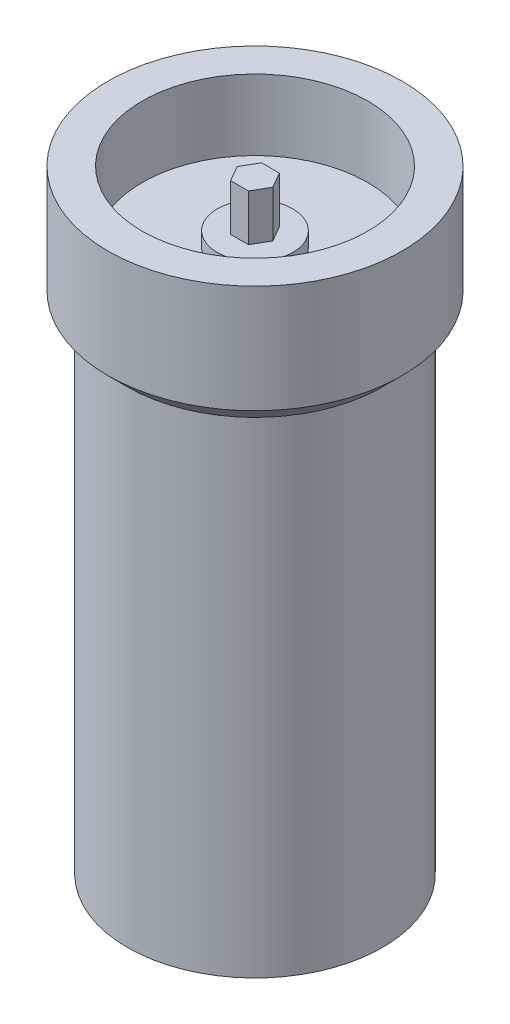
ISO-10303-21;
HEADER;
FILE_DESCRIPTION(('STEP AP214'),'2;1');
FILE_NAME('part.step','',(''),(''),'','','');
FILE_SCHEMA(('AUTOMOTIVE_DESIGN { 1 0 10303 214 1 1 1 1 }'));
ENDSEC;
DATA;
#1=APPLICATION_CONTEXT('core data for automotive mechanical design processes');
#2=APPLICATION_PROTOCOL_DEFINITION('international standard','automotive_design',2000,#1);
#3=PRODUCT_CONTEXT('',#1,'mechanical');
#4=PRODUCT('Part','Part','',(#3));
#5=PRODUCT_RELATED_PRODUCT_CATEGORY('part','',(#4));
#6=PRODUCT_DEFINITION_FORMATION('','',#4);
#7=PRODUCT_DEFINITION_CONTEXT('part definition',#1,'design');
#8=PRODUCT_DEFINITION('design','',#6,#7);
#9=PRODUCT_DEFINITION_SHAPE('','',#8);
#10=(LENGTH_UNIT() NAMED_UNIT(*) SI_UNIT(.MILLI.,.METRE.));
#11=(NAMED_UNIT(*) PLANE_ANGLE_UNIT() SI_UNIT($,.RADIAN.));
#12=(NAMED_UNIT(*) SI_UNIT($,.STERADIAN.) SOLID_ANGLE_UNIT());
#13=UNCERTAINTY_MEASURE_WITH_UNIT(LENGTH_MEASURE(1.E-05),#10,'distance_accuracy_value','');
#14=(GEOMETRIC_REPRESENTATION_CONTEXT(3) GLOBAL_UNCERTAINTY_ASSIGNED_CONTEXT((#13)) GLOBAL_UNIT_ASSIGNED_CONTEXT((#10,
#11,#12)) REPRESENTATION_CONTEXT('',''));
#15=CARTESIAN_POINT('',(0.,0.,0.));
#16=DIRECTION('',(0.,0.,1.));
#17=DIRECTION('',(1.,0.,0.));
#18=AXIS2_PLACEMENT_3D('',#15,#16,#17);
#19=CARTESIAN_POINT('',(0.,113.6,0.));
#20=DIRECTION('',(0.,-1.,0.));
#21=DIRECTION('',(0.,0.,-1.));
#22=AXIS2_PLACEMENT_3D('',#19,#20,#21);
#23=CYLINDRICAL_SURFACE('',#22,7.7);
#24=CARTESIAN_POINT('',(0.,113.6,0.));
#25=DIRECTION('',(0.,1.,0.));
#26=DIRECTION('',(0.,0.,1.));
#27=AXIS2_PLACEMENT_3D('',#24,#25,#26);
#28=CIRCLE('',#27,7.7);
#29=CARTESIAN_POINT('',(0.,113.6,7.7));
#30=VERTEX_POINT('',#29);
#31=EDGE_CURVE('E11',#30,#30,#28,.T.);
#32=ORIENTED_EDGE('',*,*,#31,.F.);
#33=EDGE_LOOP('',(#32));
#34=FACE_BOUND('',#33,.T.);
#35=CARTESIAN_POINT('',(0.,110.6,0.));
#36=DIRECTION('',(0.,1.,0.));
#37=DIRECTION('',(0.,0.,1.));
#38=AXIS2_PLACEMENT_3D('',#35,#36,#37);
#39=CIRCLE('',#38,7.7);
#40=CARTESIAN_POINT('',(0.,110.6,7.7));
#41=VERTEX_POINT('',#40);
#42=EDGE_CURVE('E49',#41,#41,#39,.T.);
#43=ORIENTED_EDGE('',*,*,#42,.T.);
#44=EDGE_LOOP('',(#43));
#45=FACE_BOUND('',#44,.T.);
#46=ADVANCED_FACE('F46',(#34,#45),#23,.T.);
#47=CARTESIAN_POINT('',(0.,113.6,0.));
#48=DIRECTION('',(0.,1.,0.));
#49=DIRECTION('',(0.,0.,1.));
#50=AXIS2_PLACEMENT_3D('',#47,#48,#49);
#51=PLANE('',#50);
#52=ORIENTED_EDGE('',*,*,#31,.T.);
#53=EDGE_LOOP('',(#52));
#54=FACE_BOUND('',#53,.T.);
#55=ADVANCED_FACE('F61',(#54),#51,.T.);
#56=CARTESIAN_POINT('',(0.,110.6,0.));
#57=DIRECTION('',(0.,1.,0.));
#58=DIRECTION('',(0.,0.,1.));
#59=AXIS2_PLACEMENT_3D('',#56,#57,#58);
#60=PLANE('',#59);
#61=ORIENTED_EDGE('',*,*,#42,.F.);
#62=EDGE_LOOP('',(#61));
#63=FACE_BOUND('',#62,.T.);
#64=ADVANCED_FACE('F59',(#63),#60,.F.);
#65=CLOSED_SHELL('',(#46,#55,#64));
#66=MANIFOLD_SOLID_BREP('B2',#65);
#67=CARTESIAN_POINT('',(1.81865334794732,123.1,3.15));
#68=DIRECTION('',(-0.866025403784439,0.,-0.5));
#69=DIRECTION('',(-0.5,0.,0.866025403784439));
#70=AXIS2_PLACEMENT_3D('',#67,#68,#69);
#71=PLANE('',#70);
#72=DIRECTION('',(0.5,0.,-0.866025403784439));
#73=VECTOR('',#72,1.);
#74=CARTESIAN_POINT('',(1.81865334794732,110.6,3.15));
#75=LINE('',#74,#73);
#76=CARTESIAN_POINT('',(1.81865334794732,110.6,3.15));
#77=VERTEX_POINT('',#76);
#78=CARTESIAN_POINT('',(3.63730669589464,110.6,0.));
#79=VERTEX_POINT('',#78);
#80=EDGE_CURVE('E178',#77,#79,#75,.T.);
#81=ORIENTED_EDGE('',*,*,#80,.T.);
#82=DIRECTION('',(0.,-1.,0.));
#83=VECTOR('',#82,1.);
#84=CARTESIAN_POINT('',(3.63730669589464,123.1,0.));
#85=LINE('',#84,#83);
#86=CARTESIAN_POINT('',(3.63730669589464,123.1,0.));
#87=VERTEX_POINT('',#86);
#88=EDGE_CURVE('E44',#87,#79,#85,.T.);
#89=ORIENTED_EDGE('',*,*,#88,.F.);
#90=DIRECTION('',(0.5,0.,-0.866025403784439));
#91=VECTOR('',#90,1.);
#92=CARTESIAN_POINT('',(1.81865334794732,123.1,3.15));
#93=LINE('',#92,#91);
#94=CARTESIAN_POINT('',(1.81865334794732,123.1,3.15));
#95=VERTEX_POINT('',#94);
#96=EDGE_CURVE('E188',#95,#87,#93,.T.);
#97=ORIENTED_EDGE('',*,*,#96,.F.);
#98=DIRECTION('',(0.,-1.,0.));
#99=VECTOR('',#98,1.);
#100=CARTESIAN_POINT('',(1.81865334794732,123.1,3.15));
#101=LINE('',#100,#99);
#102=EDGE_CURVE('E174',#95,#77,#101,.T.);
#103=ORIENTED_EDGE('',*,*,#102,.T.);
#104=EDGE_LOOP('',(#81,#89,#97,#103));
#105=FACE_BOUND('',#104,.T.);
#106=ADVANCED_FACE('F94',(#105),#71,.F.);
#107=CARTESIAN_POINT('',(3.63730669589464,123.1,0.));
#108=DIRECTION('',(-0.866025403784438,0.,0.5));
#109=DIRECTION('',(0.5,0.,0.866025403784438));
#110=AXIS2_PLACEMENT_3D('',#107,#108,#109);
#111=PLANE('',#110);
#112=DIRECTION('',(-0.5,0.,-0.866025403784439));
#113=VECTOR('',#112,1.);
#114=CARTESIAN_POINT('',(3.63730669589464,110.6,0.));
#115=LINE('',#114,#113);
#116=CARTESIAN_POINT('',(1.81865334794732,110.6,-3.15000000000001));
#117=VERTEX_POINT('',#116);
#118=EDGE_CURVE('E181',#79,#117,#115,.T.);
#119=ORIENTED_EDGE('',*,*,#118,.T.);
#120=DIRECTION('',(0.,-1.,0.));
#121=VECTOR('',#120,1.);
#122=CARTESIAN_POINT('',(1.81865334794732,123.1,-3.15000000000001));
#123=LINE('',#122,#121);
#124=CARTESIAN_POINT('',(1.81865334794732,123.1,-3.15000000000001));
#125=VERTEX_POINT('',#124);
#126=EDGE_CURVE('E102',#125,#117,#123,.T.);
#127=ORIENTED_EDGE('',*,*,#126,.F.);
#128=DIRECTION('',(-0.5,0.,-0.866025403784439));
#129=VECTOR('',#128,1.);
#130=CARTESIAN_POINT('',(3.63730669589464,123.1,0.));
#131=LINE('',#130,#129);
#132=EDGE_CURVE('E147',#87,#125,#131,.T.);
#133=ORIENTED_EDGE('',*,*,#132,.F.);
#134=ORIENTED_EDGE('',*,*,#88,.T.);
#135=EDGE_LOOP('',(#119,#127,#133,#134));
#136=FACE_BOUND('',#135,.T.);
#137=ADVANCED_FACE('F212',(#136),#111,.F.);
#138=CARTESIAN_POINT('',(1.81865334794732,123.1,-3.15000000000001));
#139=DIRECTION('',(0.,0.,1.));
#140=DIRECTION('',(1.,0.,0.));
#141=AXIS2_PLACEMENT_3D('',#138,#139,#140);
#142=PLANE('',#141);
#143=DIRECTION('',(-1.,0.,0.));
#144=VECTOR('',#143,1.);
#145=CARTESIAN_POINT('',(1.81865334794732,110.6,-3.15000000000001));
#146=LINE('',#145,#144);
#147=CARTESIAN_POINT('',(-1.81865334794732,110.6,-3.15000000000001));
#148=VERTEX_POINT('',#147);
#149=EDGE_CURVE('E183',#117,#148,#146,.T.);
#150=ORIENTED_EDGE('',*,*,#149,.T.);
#151=DIRECTION('',(0.,-1.,0.));
#152=VECTOR('',#151,1.);
#153=CARTESIAN_POINT('',(-1.81865334794732,123.1,-3.15000000000001));
#154=LINE('',#153,#152);
#155=CARTESIAN_POINT('',(-1.81865334794732,123.1,-3.15000000000001));
#156=VERTEX_POINT('',#155);
#157=EDGE_CURVE('E169',#156,#148,#154,.T.);
#158=ORIENTED_EDGE('',*,*,#157,.F.);
#159=DIRECTION('',(-1.,0.,0.));
#160=VECTOR('',#159,1.);
#161=CARTESIAN_POINT('',(1.81865334794732,123.1,-3.15000000000001));
#162=LINE('',#161,#160);
#163=EDGE_CURVE('E160',#125,#156,#162,.T.);
#164=ORIENTED_EDGE('',*,*,#163,.F.);
#165=ORIENTED_EDGE('',*,*,#126,.T.);
#166=EDGE_LOOP('',(#150,#158,#164,#165));
#167=FACE_BOUND('',#166,.T.);
#168=ADVANCED_FACE('F194',(#167),#142,.F.);
#169=CARTESIAN_POINT('',(-1.81865334794732,123.1,-3.15000000000001));
#170=DIRECTION('',(0.866025403784439,0.,0.5));
#171=DIRECTION('',(0.5,0.,-0.866025403784439));
#172=AXIS2_PLACEMENT_3D('',#169,#170,#171);
#173=PLANE('',#172);
#174=DIRECTION('',(-0.5,0.,0.866025403784439));
#175=VECTOR('',#174,1.);
#176=CARTESIAN_POINT('',(-1.81865334794732,110.6,-3.15000000000001));
#177=LINE('',#176,#175);
#178=CARTESIAN_POINT('',(-3.63730669589465,110.6,0.));
#179=VERTEX_POINT('',#178);
#180=EDGE_CURVE('E168',#148,#179,#177,.T.);
#181=ORIENTED_EDGE('',*,*,#180,.T.);
#182=DIRECTION('',(0.,-1.,0.));
#183=VECTOR('',#182,1.);
#184=CARTESIAN_POINT('',(-3.63730669589465,123.1,0.));
#185=LINE('',#184,#183);
#186=CARTESIAN_POINT('',(-3.63730669589465,123.1,0.));
#187=VERTEX_POINT('',#186);
#188=EDGE_CURVE('E165',#187,#179,#185,.T.);
#189=ORIENTED_EDGE('',*,*,#188,.F.);
#190=DIRECTION('',(-0.5,0.,0.866025403784439));
#191=VECTOR('',#190,1.);
#192=CARTESIAN_POINT('',(-1.81865334794732,123.1,-3.15000000000001));
#193=LINE('',#192,#191);
#194=EDGE_CURVE('E154',#156,#187,#193,.T.);
#195=ORIENTED_EDGE('',*,*,#194,.F.);
#196=ORIENTED_EDGE('',*,*,#157,.T.);
#197=EDGE_LOOP('',(#181,#189,#195,#196));
#198=FACE_BOUND('',#197,.T.);
#199=ADVANCED_FACE('F166',(#198),#173,.F.);
#200=CARTESIAN_POINT('',(-3.63730669589465,123.1,0.));
#201=DIRECTION('',(0.866025403784439,0.,-0.5));
#202=DIRECTION('',(-0.5,0.,-0.866025403784439));
#203=AXIS2_PLACEMENT_3D('',#200,#201,#202);
#204=PLANE('',#203);
#205=DIRECTION('',(0.5,0.,0.866025403784439));
#206=VECTOR('',#205,1.);
#207=CARTESIAN_POINT('',(-3.63730669589465,110.6,0.));
#208=LINE('',#207,#206);
#209=CARTESIAN_POINT('',(-1.81865334794733,110.6,3.15));
#210=VERTEX_POINT('',#209);
#211=EDGE_CURVE('E133',#179,#210,#208,.T.);
#212=ORIENTED_EDGE('',*,*,#211,.T.);
#213=DIRECTION('',(0.,-1.,0.));
#214=VECTOR('',#213,1.);
#215=CARTESIAN_POINT('',(-1.81865334794733,123.1,3.15));
#216=LINE('',#215,#214);
#217=CARTESIAN_POINT('',(-1.81865334794733,123.1,3.15));
#218=VERTEX_POINT('',#217);
#219=EDGE_CURVE('E170',#218,#210,#216,.T.);
#220=ORIENTED_EDGE('',*,*,#219,.F.);
#221=DIRECTION('',(0.5,0.,0.866025403784439));
#222=VECTOR('',#221,1.);
#223=CARTESIAN_POINT('',(-3.63730669589465,123.1,0.));
#224=LINE('',#223,#222);
#225=EDGE_CURVE('E158',#187,#218,#224,.T.);
#226=ORIENTED_EDGE('',*,*,#225,.F.);
#227=ORIENTED_EDGE('',*,*,#188,.T.);
#228=EDGE_LOOP('',(#212,#220,#226,#227));
#229=FACE_BOUND('',#228,.T.);
#230=ADVANCED_FACE('F172',(#229),#204,.F.);
#231=CARTESIAN_POINT('',(-1.81865334794733,123.1,3.15));
#232=DIRECTION('',(0.,0.,-1.));
#233=DIRECTION('',(-1.,0.,0.));
#234=AXIS2_PLACEMENT_3D('',#231,#232,#233);
#235=PLANE('',#234);
#236=DIRECTION('',(1.,0.,0.));
#237=VECTOR('',#236,1.);
#238=CARTESIAN_POINT('',(-1.81865334794733,110.6,3.15));
#239=LINE('',#238,#237);
#240=EDGE_CURVE('E139',#210,#77,#239,.T.);
#241=ORIENTED_EDGE('',*,*,#240,.T.);
#242=ORIENTED_EDGE('',*,*,#102,.F.);
#243=DIRECTION('',(1.,0.,0.));
#244=VECTOR('',#243,1.);
#245=CARTESIAN_POINT('',(-1.81865334794733,123.1,3.15));
#246=LINE('',#245,#244);
#247=EDGE_CURVE('E110',#218,#95,#246,.T.);
#248=ORIENTED_EDGE('',*,*,#247,.F.);
#249=ORIENTED_EDGE('',*,*,#219,.T.);
#250=EDGE_LOOP('',(#241,#242,#248,#249));
#251=FACE_BOUND('',#250,.T.);
#252=ADVANCED_FACE('F201',(#251),#235,.F.);
#253=CARTESIAN_POINT('',(0.,123.1,0.));
#254=DIRECTION('',(0.,1.,0.));
#255=DIRECTION('',(0.,0.,1.));
#256=AXIS2_PLACEMENT_3D('',#253,#254,#255);
#257=PLANE('',#256);
#258=ORIENTED_EDGE('',*,*,#96,.T.);
#259=ORIENTED_EDGE('',*,*,#132,.T.);
#260=ORIENTED_EDGE('',*,*,#163,.T.);
#261=ORIENTED_EDGE('',*,*,#194,.T.);
#262=ORIENTED_EDGE('',*,*,#225,.T.);
#263=ORIENTED_EDGE('',*,*,#247,.T.);
#264=EDGE_LOOP('',(#258,#259,#260,#261,#262,#263));
#265=FACE_BOUND('',#264,.T.);
#266=ADVANCED_FACE('F156',(#265),#257,.T.);
#267=CARTESIAN_POINT('',(0.,110.6,0.));
#268=DIRECTION('',(0.,1.,0.));
#269=DIRECTION('',(0.,0.,1.));
#270=AXIS2_PLACEMENT_3D('',#267,#268,#269);
#271=PLANE('',#270);
#272=ORIENTED_EDGE('',*,*,#80,.F.);
#273=ORIENTED_EDGE('',*,*,#240,.F.);
#274=ORIENTED_EDGE('',*,*,#211,.F.);
#275=ORIENTED_EDGE('',*,*,#180,.F.);
#276=ORIENTED_EDGE('',*,*,#149,.F.);
#277=ORIENTED_EDGE('',*,*,#118,.F.);
#278=EDGE_LOOP('',(#272,#273,#274,#275,#276,#277));
#279=FACE_BOUND('',#278,.T.);
#280=ADVANCED_FACE('F197',(#279),#271,.F.);
#281=CLOSED_SHELL('',(#106,#137,#168,#199,#230,#252,#266,#280));
#282=MANIFOLD_SOLID_BREP('B6',#281);
#283=CARTESIAN_POINT('',(26.,0.,0.));
#284=DIRECTION('',(0.,-1.,0.));
#285=DIRECTION('',(0.,0.,-1.));
#286=AXIS2_PLACEMENT_3D('',#283,#284,#285);
#287=PLANE('',#286);
#288=CARTESIAN_POINT('',(0.,0.,0.));
#289=DIRECTION('',(0.,-1.,0.));
#290=DIRECTION('',(0.,0.,-1.));
#291=AXIS2_PLACEMENT_3D('',#288,#289,#290);
#292=CIRCLE('',#291,26.);
#293=CARTESIAN_POINT('',(0.,0.,-26.));
#294=VERTEX_POINT('',#293);
#295=EDGE_CURVE('E284',#294,#294,#292,.T.);
#296=ORIENTED_EDGE('',*,*,#295,.T.);
#297=EDGE_LOOP('',(#296));
#298=FACE_BOUND('',#297,.T.);
#299=ADVANCED_FACE('F270',(#298),#287,.T.);
#300=CARTESIAN_POINT('',(0.,125.,0.));
#301=DIRECTION('',(0.,1.,0.));
#302=DIRECTION('',(0.,0.,1.));
#303=AXIS2_PLACEMENT_3D('',#300,#301,#302);
#304=PLANE('',#303);
#305=CARTESIAN_POINT('',(0.,125.,0.));
#306=DIRECTION('',(0.,1.,0.));
#307=DIRECTION('',(0.,0.,1.));
#308=AXIS2_PLACEMENT_3D('',#305,#306,#307);
#309=CIRCLE('',#308,23.);
#310=CARTESIAN_POINT('',(0.,125.,23.));
#311=VERTEX_POINT('',#310);
#312=EDGE_CURVE('E290',#311,#311,#309,.T.);
#313=ORIENTED_EDGE('',*,*,#312,.F.);
#314=EDGE_LOOP('',(#313));
#315=FACE_BOUND('',#314,.T.);
#316=CARTESIAN_POINT('',(0.,125.,0.));
#317=DIRECTION('',(0.,-1.,0.));
#318=DIRECTION('',(0.,0.,-1.));
#319=AXIS2_PLACEMENT_3D('',#316,#317,#318);
#320=CIRCLE('',#319,30.);
#321=CARTESIAN_POINT('',(0.,125.,-30.));
#322=VERTEX_POINT('',#321);
#323=EDGE_CURVE('E93',#322,#322,#320,.T.);
#324=ORIENTED_EDGE('',*,*,#323,.F.);
#325=EDGE_LOOP('',(#324));
#326=FACE_BOUND('',#325,.T.);
#327=ADVANCED_FACE('F305',(#315,#326),#304,.T.);
#328=CARTESIAN_POINT('',(0.,0.,0.));
#329=DIRECTION('',(0.,-1.,0.));
#330=DIRECTION('',(0.,0.,-1.));
#331=AXIS2_PLACEMENT_3D('',#328,#329,#330);
#332=CYLINDRICAL_SURFACE('',#331,30.);
#333=ORIENTED_EDGE('',*,*,#323,.T.);
#334=EDGE_LOOP('',(#333));
#335=FACE_BOUND('',#334,.T.);
#336=CARTESIAN_POINT('',(0.,103.,0.));
#337=DIRECTION('',(0.,-1.,0.));
#338=DIRECTION('',(0.,0.,-1.));
#339=AXIS2_PLACEMENT_3D('',#336,#337,#338);
#340=CIRCLE('',#339,30.);
#341=CARTESIAN_POINT('',(0.,103.,-30.));
#342=VERTEX_POINT('',#341);
#343=EDGE_CURVE('E276',#342,#342,#340,.T.);
#344=ORIENTED_EDGE('',*,*,#343,.F.);
#345=EDGE_LOOP('',(#344));
#346=FACE_BOUND('',#345,.T.);
#347=ADVANCED_FACE('F308',(#335,#346),#332,.T.);
#348=CARTESIAN_POINT('',(0.,98.9999999999999,0.));
#349=DIRECTION('',(0.,1.,0.));
#350=DIRECTION('',(0.,0.,1.));
#351=AXIS2_PLACEMENT_3D('',#348,#349,#350);
#352=CONICAL_SURFACE('',#351,26.,0.785398163397441);
#353=ORIENTED_EDGE('',*,*,#343,.T.);
#354=EDGE_LOOP('',(#353));
#355=FACE_BOUND('',#354,.T.);
#356=CARTESIAN_POINT('',(0.,98.9999999999999,0.));
#357=DIRECTION('',(0.,-1.,0.));
#358=DIRECTION('',(0.,0.,-1.));
#359=AXIS2_PLACEMENT_3D('',#356,#357,#358);
#360=CIRCLE('',#359,26.);
#361=CARTESIAN_POINT('',(0.,98.9999999999999,-26.));
#362=VERTEX_POINT('',#361);
#363=EDGE_CURVE('E280',#362,#362,#360,.T.);
#364=ORIENTED_EDGE('',*,*,#363,.F.);
#365=EDGE_LOOP('',(#364));
#366=FACE_BOUND('',#365,.T.);
#367=ADVANCED_FACE('F313',(#355,#366),#352,.T.);
#368=CARTESIAN_POINT('',(0.,0.,0.));
#369=DIRECTION('',(0.,-1.,0.));
#370=DIRECTION('',(0.,0.,-1.));
#371=AXIS2_PLACEMENT_3D('',#368,#369,#370);
#372=CYLINDRICAL_SURFACE('',#371,26.);
#373=ORIENTED_EDGE('',*,*,#363,.T.);
#374=EDGE_LOOP('',(#373));
#375=FACE_BOUND('',#374,.T.);
#376=ORIENTED_EDGE('',*,*,#295,.F.);
#377=EDGE_LOOP('',(#376));
#378=FACE_BOUND('',#377,.T.);
#379=ADVANCED_FACE('F301',(#375,#378),#372,.T.);
#380=CARTESIAN_POINT('',(0.,110.6,0.));
#381=DIRECTION('',(0.,1.,0.));
#382=DIRECTION('',(0.,0.,1.));
#383=AXIS2_PLACEMENT_3D('',#380,#381,#382);
#384=CYLINDRICAL_SURFACE('',#383,23.);
#385=CARTESIAN_POINT('',(0.,110.6,0.));
#386=DIRECTION('',(0.,1.,0.));
#387=DIRECTION('',(0.,0.,1.));
#388=AXIS2_PLACEMENT_3D('',#385,#386,#387);
#389=CIRCLE('',#388,23.);
#390=CARTESIAN_POINT('',(0.,110.6,23.));
#391=VERTEX_POINT('',#390);
#392=EDGE_CURVE('E289',#391,#391,#389,.T.);
#393=ORIENTED_EDGE('',*,*,#392,.F.);
#394=EDGE_LOOP('',(#393));
#395=FACE_BOUND('',#394,.T.);
#396=ORIENTED_EDGE('',*,*,#312,.T.);
#397=EDGE_LOOP('',(#396));
#398=FACE_BOUND('',#397,.T.);
#399=ADVANCED_FACE('F298',(#395,#398),#384,.F.);
#400=CARTESIAN_POINT('',(0.,110.6,0.));
#401=DIRECTION('',(0.,1.,0.));
#402=DIRECTION('',(0.,0.,1.));
#403=AXIS2_PLACEMENT_3D('',#400,#401,#402);
#404=PLANE('',#403);
#405=ORIENTED_EDGE('',*,*,#392,.T.);
#406=EDGE_LOOP('',(#405));
#407=FACE_BOUND('',#406,.T.);
#408=ADVANCED_FACE('F296',(#407),#404,.T.);
#409=CLOSED_SHELL('',(#299,#327,#347,#367,#379,#399,#408));
#410=MANIFOLD_SOLID_BREP('B38',#409);
#411=ADVANCED_BREP_SHAPE_REPRESENTATION('',(#18,#66,#282,#410),#14);
#412=SHAPE_DEFINITION_REPRESENTATION(#9,#411);
ENDSEC;
END-ISO-10303-21;
